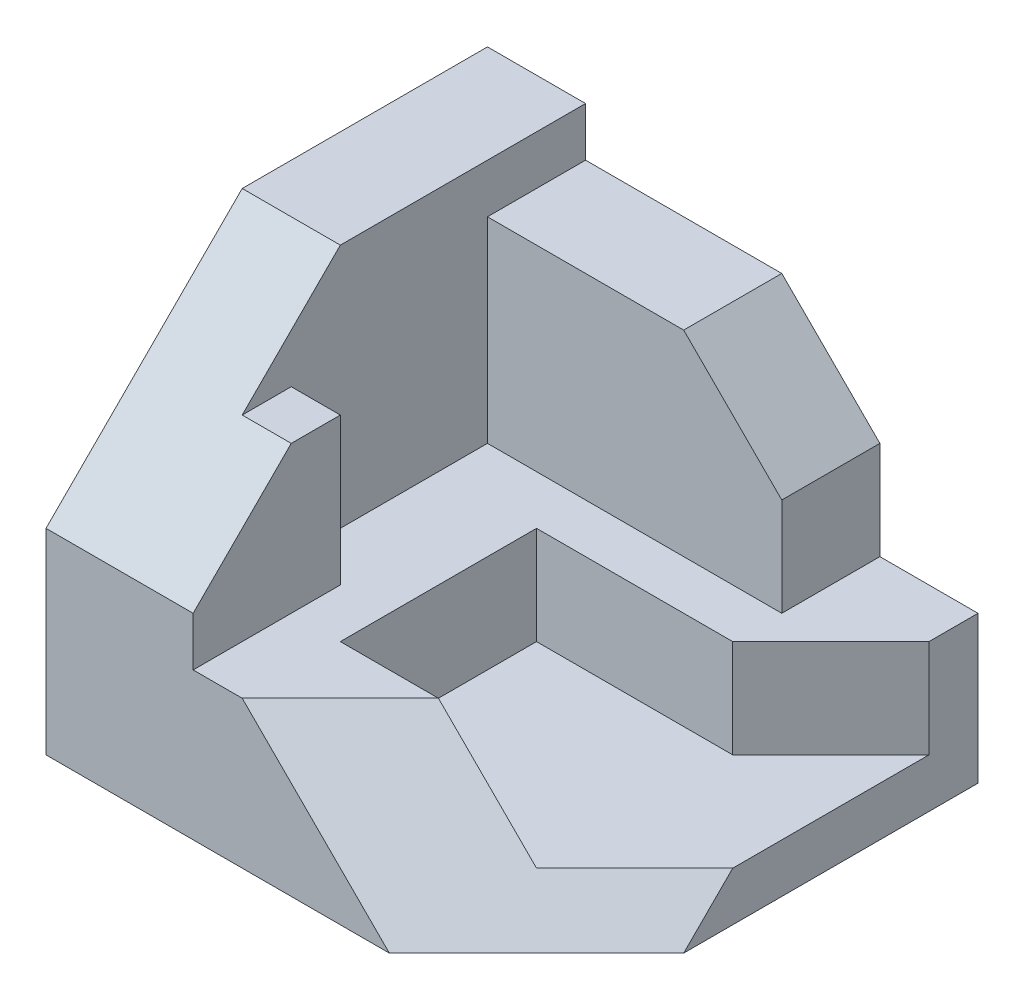
ISO-10303-21;
HEADER;
FILE_DESCRIPTION(('STEP AP214'),'2;1');
FILE_NAME('part.step','',(''),(''),'','','');
FILE_SCHEMA(('AUTOMOTIVE_DESIGN { 1 0 10303 214 1 1 1 1 }'));
ENDSEC;
DATA;
#1=APPLICATION_CONTEXT('core data for automotive mechanical design processes');
#2=APPLICATION_PROTOCOL_DEFINITION('international standard','automotive_design',2000,#1);
#3=PRODUCT_CONTEXT('',#1,'mechanical');
#4=PRODUCT('Part','Part','',(#3));
#5=PRODUCT_RELATED_PRODUCT_CATEGORY('part','',(#4));
#6=PRODUCT_DEFINITION_FORMATION('','',#4);
#7=PRODUCT_DEFINITION_CONTEXT('part definition',#1,'design');
#8=PRODUCT_DEFINITION('design','',#6,#7);
#9=PRODUCT_DEFINITION_SHAPE('','',#8);
#10=(LENGTH_UNIT() NAMED_UNIT(*) SI_UNIT(.MILLI.,.METRE.));
#11=(NAMED_UNIT(*) PLANE_ANGLE_UNIT() SI_UNIT($,.RADIAN.));
#12=(NAMED_UNIT(*) SI_UNIT($,.STERADIAN.) SOLID_ANGLE_UNIT());
#13=UNCERTAINTY_MEASURE_WITH_UNIT(LENGTH_MEASURE(1.E-05),#10,'distance_accuracy_value','');
#14=(GEOMETRIC_REPRESENTATION_CONTEXT(3) GLOBAL_UNCERTAINTY_ASSIGNED_CONTEXT((#13)) GLOBAL_UNIT_ASSIGNED_CONTEXT((#10,
#11,#12)) REPRESENTATION_CONTEXT('',''));
#15=CARTESIAN_POINT('',(0.,0.,0.));
#16=DIRECTION('',(0.,0.,1.));
#17=DIRECTION('',(1.,0.,0.));
#18=AXIS2_PLACEMENT_3D('',#15,#16,#17);
#19=CARTESIAN_POINT('',(100.,0.,-90.));
#20=DIRECTION('',(1.,0.,0.));
#21=DIRECTION('',(0.,0.,-1.));
#22=AXIS2_PLACEMENT_3D('',#19,#20,#21);
#23=PLANE('',#22);
#24=DIRECTION('',(0.,0.,-1.));
#25=VECTOR('',#24,1.);
#26=CARTESIAN_POINT('',(100.,10.,-80.));
#27=LINE('',#26,#25);
#28=CARTESIAN_POINT('',(100.,10.,-40.0000000000001));
#29=VERTEX_POINT('',#28);
#30=CARTESIAN_POINT('',(100.,10.,-80.));
#31=VERTEX_POINT('',#30);
#32=EDGE_CURVE('E188',#29,#31,#27,.T.);
#33=ORIENTED_EDGE('',*,*,#32,.F.);
#34=DIRECTION('',(0.,-0.707106781186546,0.707106781186549));
#35=VECTOR('',#34,1.);
#36=CARTESIAN_POINT('',(100.,10.,-40.0000000000001));
#37=LINE('',#36,#35);
#38=CARTESIAN_POINT('',(100.,0.,-30.));
#39=VERTEX_POINT('',#38);
#40=EDGE_CURVE('E172',#29,#39,#37,.T.);
#41=ORIENTED_EDGE('',*,*,#40,.T.);
#42=DIRECTION('',(0.,0.,1.));
#43=VECTOR('',#42,1.);
#44=CARTESIAN_POINT('',(100.,0.,-90.));
#45=LINE('',#44,#43);
#46=CARTESIAN_POINT('',(100.,0.,-90.));
#47=VERTEX_POINT('',#46);
#48=EDGE_CURVE('E325',#47,#39,#45,.T.);
#49=ORIENTED_EDGE('',*,*,#48,.F.);
#50=DIRECTION('',(0.,1.,0.));
#51=VECTOR('',#50,1.);
#52=CARTESIAN_POINT('',(100.,0.,-90.));
#53=LINE('',#52,#51);
#54=CARTESIAN_POINT('',(100.,30.,-90.));
#55=VERTEX_POINT('',#54);
#56=EDGE_CURVE('E313',#47,#55,#53,.T.);
#57=ORIENTED_EDGE('',*,*,#56,.T.);
#58=DIRECTION('',(0.,0.,1.));
#59=VECTOR('',#58,1.);
#60=CARTESIAN_POINT('',(100.,30.,-90.));
#61=LINE('',#60,#59);
#62=CARTESIAN_POINT('',(100.,30.,-80.));
#63=VERTEX_POINT('',#62);
#64=EDGE_CURVE('E292',#55,#63,#61,.T.);
#65=ORIENTED_EDGE('',*,*,#64,.T.);
#66=DIRECTION('',(0.,1.,0.));
#67=VECTOR('',#66,1.);
#68=CARTESIAN_POINT('',(100.,10.,-80.));
#69=LINE('',#68,#67);
#70=EDGE_CURVE('E48',#31,#63,#69,.T.);
#71=ORIENTED_EDGE('',*,*,#70,.F.);
#72=EDGE_LOOP('',(#33,#41,#49,#57,#65,#71));
#73=FACE_BOUND('',#72,.T.);
#74=ADVANCED_FACE('F33',(#73),#23,.T.);
#75=CARTESIAN_POINT('',(0.,10.,0.));
#76=DIRECTION('',(0.,1.,0.));
#77=DIRECTION('',(0.,0.,1.));
#78=AXIS2_PLACEMENT_3D('',#75,#76,#77);
#79=PLANE('',#78);
#80=DIRECTION('',(1.,0.,0.));
#81=VECTOR('',#80,1.);
#82=CARTESIAN_POINT('',(40.,10.,-20.));
#83=LINE('',#82,#81);
#84=CARTESIAN_POINT('',(40.,10.,-20.));
#85=VERTEX_POINT('',#84);
#86=CARTESIAN_POINT('',(80.,10.,-20.));
#87=VERTEX_POINT('',#86);
#88=EDGE_CURVE('E191',#85,#87,#83,.T.);
#89=ORIENTED_EDGE('',*,*,#88,.T.);
#90=DIRECTION('',(0.707106781186546,0.,-0.707106781186549));
#91=VECTOR('',#90,1.);
#92=CARTESIAN_POINT('',(80.,10.,-20.));
#93=LINE('',#92,#91);
#94=EDGE_CURVE('E175',#87,#29,#93,.T.);
#95=ORIENTED_EDGE('',*,*,#94,.T.);
#96=ORIENTED_EDGE('',*,*,#32,.T.);
#97=DIRECTION('',(-0.707106781186547,0.,0.707106781186548));
#98=VECTOR('',#97,1.);
#99=CARTESIAN_POINT('',(100.,10.,-80.));
#100=LINE('',#99,#98);
#101=CARTESIAN_POINT('',(80.,10.,-60.));
#102=VERTEX_POINT('',#101);
#103=EDGE_CURVE('E194',#31,#102,#100,.T.);
#104=ORIENTED_EDGE('',*,*,#103,.T.);
#105=DIRECTION('',(-1.,0.,0.));
#106=VECTOR('',#105,1.);
#107=CARTESIAN_POINT('',(80.,10.,-60.));
#108=LINE('',#107,#106);
#109=CARTESIAN_POINT('',(40.,10.,-60.));
#110=VERTEX_POINT('',#109);
#111=EDGE_CURVE('E197',#102,#110,#108,.T.);
#112=ORIENTED_EDGE('',*,*,#111,.T.);
#113=DIRECTION('',(0.,0.,1.));
#114=VECTOR('',#113,1.);
#115=CARTESIAN_POINT('',(40.,10.,-60.));
#116=LINE('',#115,#114);
#117=EDGE_CURVE('E208',#110,#85,#116,.T.);
#118=ORIENTED_EDGE('',*,*,#117,.T.);
#119=EDGE_LOOP('',(#89,#95,#96,#104,#112,#118));
#120=FACE_BOUND('',#119,.T.);
#121=ADVANCED_FACE('F186',(#120),#79,.T.);
#122=CARTESIAN_POINT('',(80.,30.,-90.));
#123=DIRECTION('',(0.,-1.,0.));
#124=DIRECTION('',(0.,0.,-1.));
#125=AXIS2_PLACEMENT_3D('',#122,#123,#124);
#126=PLANE('',#125);
#127=DIRECTION('',(-1.,0.,0.));
#128=VECTOR('',#127,1.);
#129=CARTESIAN_POINT('',(0.,30.,0.));
#130=LINE('',#129,#128);
#131=CARTESIAN_POINT('',(40.,30.,0.));
#132=VERTEX_POINT('',#131);
#133=CARTESIAN_POINT('',(30.,30.,0.));
#134=VERTEX_POINT('',#133);
#135=EDGE_CURVE('E233',#132,#134,#130,.T.);
#136=ORIENTED_EDGE('',*,*,#135,.F.);
#137=DIRECTION('',(-0.707106781186544,0.,0.707106781186551));
#138=VECTOR('',#137,1.);
#139=CARTESIAN_POINT('',(59.9999999999998,30.,-20.));
#140=LINE('',#139,#138);
#141=CARTESIAN_POINT('',(59.9999999999998,30.,-20.));
#142=VERTEX_POINT('',#141);
#143=EDGE_CURVE('E182',#142,#132,#140,.T.);
#144=ORIENTED_EDGE('',*,*,#143,.F.);
#145=DIRECTION('',(1.,0.,0.));
#146=VECTOR('',#145,1.);
#147=CARTESIAN_POINT('',(40.,30.,-20.));
#148=LINE('',#147,#146);
#149=CARTESIAN_POINT('',(40.,30.,-20.));
#150=VERTEX_POINT('',#149);
#151=EDGE_CURVE('E195',#150,#142,#148,.T.);
#152=ORIENTED_EDGE('',*,*,#151,.F.);
#153=DIRECTION('',(0.,0.,1.));
#154=VECTOR('',#153,1.);
#155=CARTESIAN_POINT('',(40.,30.,-60.));
#156=LINE('',#155,#154);
#157=CARTESIAN_POINT('',(40.,30.,-60.));
#158=VERTEX_POINT('',#157);
#159=EDGE_CURVE('E200',#158,#150,#156,.T.);
#160=ORIENTED_EDGE('',*,*,#159,.F.);
#161=DIRECTION('',(-1.,0.,0.));
#162=VECTOR('',#161,1.);
#163=CARTESIAN_POINT('',(80.,30.,-60.));
#164=LINE('',#163,#162);
#165=CARTESIAN_POINT('',(80.,30.,-60.));
#166=VERTEX_POINT('',#165);
#167=EDGE_CURVE('E213',#166,#158,#164,.T.);
#168=ORIENTED_EDGE('',*,*,#167,.F.);
#169=DIRECTION('',(-0.707106781186547,0.,0.707106781186548));
#170=VECTOR('',#169,1.);
#171=CARTESIAN_POINT('',(100.,30.,-80.));
#172=LINE('',#171,#170);
#173=EDGE_CURVE('E211',#63,#166,#172,.T.);
#174=ORIENTED_EDGE('',*,*,#173,.F.);
#175=ORIENTED_EDGE('',*,*,#64,.F.);
#176=DIRECTION('',(1.,0.,0.));
#177=VECTOR('',#176,1.);
#178=CARTESIAN_POINT('',(80.,30.,-90.));
#179=LINE('',#178,#177);
#180=CARTESIAN_POINT('',(80.,30.,-90.));
#181=VERTEX_POINT('',#180);
#182=EDGE_CURVE('E288',#181,#55,#179,.T.);
#183=ORIENTED_EDGE('',*,*,#182,.F.);
#184=DIRECTION('',(0.,0.,1.));
#185=VECTOR('',#184,1.);
#186=CARTESIAN_POINT('',(80.,30.,-90.));
#187=LINE('',#186,#185);
#188=CARTESIAN_POINT('',(80.,30.,-70.));
#189=VERTEX_POINT('',#188);
#190=EDGE_CURVE('E295',#181,#189,#187,.T.);
#191=ORIENTED_EDGE('',*,*,#190,.T.);
#192=DIRECTION('',(1.,0.,0.));
#193=VECTOR('',#192,1.);
#194=CARTESIAN_POINT('',(20.,30.,-70.));
#195=LINE('',#194,#193);
#196=CARTESIAN_POINT('',(20.,30.,-70.));
#197=VERTEX_POINT('',#196);
#198=EDGE_CURVE('E235',#197,#189,#195,.T.);
#199=ORIENTED_EDGE('',*,*,#198,.F.);
#200=DIRECTION('',(0.,0.,1.));
#201=VECTOR('',#200,1.);
#202=CARTESIAN_POINT('',(20.,30.,-90.));
#203=LINE('',#202,#201);
#204=CARTESIAN_POINT('',(20.,30.,-30.));
#205=VERTEX_POINT('',#204);
#206=EDGE_CURVE('E247',#197,#205,#203,.T.);
#207=ORIENTED_EDGE('',*,*,#206,.T.);
#208=DIRECTION('',(1.,0.,0.));
#209=VECTOR('',#208,1.);
#210=CARTESIAN_POINT('',(20.,30.,-30.));
#211=LINE('',#210,#209);
#212=CARTESIAN_POINT('',(30.,30.,-30.));
#213=VERTEX_POINT('',#212);
#214=EDGE_CURVE('E249',#205,#213,#211,.T.);
#215=ORIENTED_EDGE('',*,*,#214,.T.);
#216=DIRECTION('',(0.,0.,-1.));
#217=VECTOR('',#216,1.);
#218=CARTESIAN_POINT('',(30.,30.,9.99999999999999));
#219=LINE('',#218,#217);
#220=EDGE_CURVE('E228',#134,#213,#219,.T.);
#221=ORIENTED_EDGE('',*,*,#220,.F.);
#222=EDGE_LOOP('',(#136,#144,#152,#160,#168,#174,#175,#183,#191,#199,#207,#215,#221));
#223=FACE_BOUND('',#222,.T.);
#224=ADVANCED_FACE('F346',(#223),#126,.F.);
#225=CARTESIAN_POINT('',(0.,0.,0.));
#226=DIRECTION('',(0.,0.,-1.));
#227=DIRECTION('',(-1.,0.,0.));
#228=AXIS2_PLACEMENT_3D('',#225,#226,#227);
#229=PLANE('',#228);
#230=DIRECTION('',(1.,0.,0.));
#231=VECTOR('',#230,1.);
#232=CARTESIAN_POINT('',(0.,0.,0.));
#233=LINE('',#232,#231);
#234=CARTESIAN_POINT('',(0.,0.,0.));
#235=VERTEX_POINT('',#234);
#236=CARTESIAN_POINT('',(70.,0.,0.));
#237=VERTEX_POINT('',#236);
#238=EDGE_CURVE('E310',#235,#237,#233,.T.);
#239=ORIENTED_EDGE('',*,*,#238,.T.);
#240=DIRECTION('',(0.707106781186548,-0.707106781186547,0.));
#241=VECTOR('',#240,1.);
#242=CARTESIAN_POINT('',(40.,30.,0.));
#243=LINE('',#242,#241);
#244=EDGE_CURVE('E388',#132,#237,#243,.T.);
#245=ORIENTED_EDGE('',*,*,#244,.F.);
#246=ORIENTED_EDGE('',*,*,#135,.T.);
#247=DIRECTION('',(0.,1.,0.));
#248=VECTOR('',#247,1.);
#249=CARTESIAN_POINT('',(30.,0.,0.));
#250=LINE('',#249,#248);
#251=CARTESIAN_POINT('',(30.,40.,0.));
#252=VERTEX_POINT('',#251);
#253=EDGE_CURVE('E231',#134,#252,#250,.T.);
#254=ORIENTED_EDGE('',*,*,#253,.T.);
#255=DIRECTION('',(-1.,0.,0.));
#256=VECTOR('',#255,1.);
#257=CARTESIAN_POINT('',(90.,40.,0.));
#258=LINE('',#257,#256);
#259=CARTESIAN_POINT('',(0.,40.,0.));
#260=VERTEX_POINT('',#259);
#261=EDGE_CURVE('E273',#252,#260,#258,.T.);
#262=ORIENTED_EDGE('',*,*,#261,.T.);
#263=DIRECTION('',(0.,-1.,0.));
#264=VECTOR('',#263,1.);
#265=CARTESIAN_POINT('',(0.,0.,0.));
#266=LINE('',#265,#264);
#267=EDGE_CURVE('E294',#260,#235,#266,.T.);
#268=ORIENTED_EDGE('',*,*,#267,.T.);
#269=EDGE_LOOP('',(#239,#245,#246,#254,#262,#268));
#270=FACE_BOUND('',#269,.T.);
#271=ADVANCED_FACE('F341',(#270),#229,.F.);
#272=CARTESIAN_POINT('',(20.,80.,-90.));
#273=DIRECTION('',(-1.,0.,0.));
#274=DIRECTION('',(0.,0.,1.));
#275=AXIS2_PLACEMENT_3D('',#272,#273,#274);
#276=PLANE('',#275);
#277=DIRECTION('',(0.,-1.,0.));
#278=VECTOR('',#277,1.);
#279=CARTESIAN_POINT('',(20.,70.,-70.));
#280=LINE('',#279,#278);
#281=CARTESIAN_POINT('',(20.,70.,-70.));
#282=VERTEX_POINT('',#281);
#283=EDGE_CURVE('E56',#282,#197,#280,.T.);
#284=ORIENTED_EDGE('',*,*,#283,.F.);
#285=DIRECTION('',(0.,0.,1.));
#286=VECTOR('',#285,1.);
#287=CARTESIAN_POINT('',(20.,70.,-90.));
#288=LINE('',#287,#286);
#289=CARTESIAN_POINT('',(20.,70.,-90.));
#290=VERTEX_POINT('',#289);
#291=EDGE_CURVE('E236',#290,#282,#288,.T.);
#292=ORIENTED_EDGE('',*,*,#291,.F.);
#293=DIRECTION('',(0.,-1.,0.));
#294=VECTOR('',#293,1.);
#295=CARTESIAN_POINT('',(20.,80.,-90.));
#296=LINE('',#295,#294);
#297=CARTESIAN_POINT('',(20.,80.,-90.));
#298=VERTEX_POINT('',#297);
#299=EDGE_CURVE('E279',#298,#290,#296,.T.);
#300=ORIENTED_EDGE('',*,*,#299,.F.);
#301=DIRECTION('',(0.,0.,1.));
#302=VECTOR('',#301,1.);
#303=CARTESIAN_POINT('',(20.,80.,-90.));
#304=LINE('',#303,#302);
#305=CARTESIAN_POINT('',(20.,80.,-40.));
#306=VERTEX_POINT('',#305);
#307=EDGE_CURVE('E291',#298,#306,#304,.T.);
#308=ORIENTED_EDGE('',*,*,#307,.T.);
#309=DIRECTION('',(0.,-0.707106781186547,0.707106781186547));
#310=VECTOR('',#309,1.);
#311=CARTESIAN_POINT('',(20.,105.,-65.));
#312=LINE('',#311,#310);
#313=CARTESIAN_POINT('',(20.,60.,-20.));
#314=VERTEX_POINT('',#313);
#315=EDGE_CURVE('E275',#306,#314,#312,.T.);
#316=ORIENTED_EDGE('',*,*,#315,.T.);
#317=DIRECTION('',(0.,0.,-1.));
#318=VECTOR('',#317,1.);
#319=CARTESIAN_POINT('',(20.,60.,30.));
#320=LINE('',#319,#318);
#321=CARTESIAN_POINT('',(20.,60.,-30.));
#322=VERTEX_POINT('',#321);
#323=EDGE_CURVE('E255',#314,#322,#320,.T.);
#324=ORIENTED_EDGE('',*,*,#323,.T.);
#325=DIRECTION('',(0.,1.,0.));
#326=VECTOR('',#325,1.);
#327=CARTESIAN_POINT('',(20.,10.,-30.));
#328=LINE('',#327,#326);
#329=EDGE_CURVE('E267',#205,#322,#328,.T.);
#330=ORIENTED_EDGE('',*,*,#329,.F.);
#331=ORIENTED_EDGE('',*,*,#206,.F.);
#332=EDGE_LOOP('',(#284,#292,#300,#308,#316,#324,#330,#331));
#333=FACE_BOUND('',#332,.T.);
#334=ADVANCED_FACE('F352',(#333),#276,.F.);
#335=CARTESIAN_POINT('',(0.,0.,-90.));
#336=DIRECTION('',(-1.,0.,0.));
#337=DIRECTION('',(0.,0.,1.));
#338=AXIS2_PLACEMENT_3D('',#335,#336,#337);
#339=PLANE('',#338);
#340=DIRECTION('',(0.,-0.707106781186548,0.707106781186548));
#341=VECTOR('',#340,1.);
#342=CARTESIAN_POINT('',(0.,80.,-40.));
#343=LINE('',#342,#341);
#344=CARTESIAN_POINT('',(0.,80.,-40.));
#345=VERTEX_POINT('',#344);
#346=EDGE_CURVE('E269',#345,#260,#343,.T.);
#347=ORIENTED_EDGE('',*,*,#346,.F.);
#348=DIRECTION('',(0.,0.,1.));
#349=VECTOR('',#348,1.);
#350=CARTESIAN_POINT('',(0.,80.,-90.));
#351=LINE('',#350,#349);
#352=CARTESIAN_POINT('',(0.,80.,-90.));
#353=VERTEX_POINT('',#352);
#354=EDGE_CURVE('E322',#353,#345,#351,.T.);
#355=ORIENTED_EDGE('',*,*,#354,.F.);
#356=DIRECTION('',(0.,-1.,0.));
#357=VECTOR('',#356,1.);
#358=CARTESIAN_POINT('',(0.,0.,-90.));
#359=LINE('',#358,#357);
#360=CARTESIAN_POINT('',(0.,0.,-90.));
#361=VERTEX_POINT('',#360);
#362=EDGE_CURVE('E306',#353,#361,#359,.T.);
#363=ORIENTED_EDGE('',*,*,#362,.T.);
#364=DIRECTION('',(0.,0.,1.));
#365=VECTOR('',#364,1.);
#366=CARTESIAN_POINT('',(0.,0.,-90.));
#367=LINE('',#366,#365);
#368=EDGE_CURVE('E318',#361,#235,#367,.T.);
#369=ORIENTED_EDGE('',*,*,#368,.T.);
#370=ORIENTED_EDGE('',*,*,#267,.F.);
#371=EDGE_LOOP('',(#347,#355,#363,#369,#370));
#372=FACE_BOUND('',#371,.T.);
#373=ADVANCED_FACE('F35',(#372),#339,.T.);
#374=CARTESIAN_POINT('',(0.,80.,-90.));
#375=DIRECTION('',(0.,1.,0.));
#376=DIRECTION('',(0.,0.,1.));
#377=AXIS2_PLACEMENT_3D('',#374,#375,#376);
#378=PLANE('',#377);
#379=DIRECTION('',(-1.,0.,0.));
#380=VECTOR('',#379,1.);
#381=CARTESIAN_POINT('',(90.,80.,-40.));
#382=LINE('',#381,#380);
#383=EDGE_CURVE('E272',#306,#345,#382,.T.);
#384=ORIENTED_EDGE('',*,*,#383,.F.);
#385=ORIENTED_EDGE('',*,*,#307,.F.);
#386=DIRECTION('',(-1.,0.,0.));
#387=VECTOR('',#386,1.);
#388=CARTESIAN_POINT('',(0.,80.,-90.));
#389=LINE('',#388,#387);
#390=EDGE_CURVE('E316',#298,#353,#389,.T.);
#391=ORIENTED_EDGE('',*,*,#390,.T.);
#392=ORIENTED_EDGE('',*,*,#354,.T.);
#393=EDGE_LOOP('',(#384,#385,#391,#392));
#394=FACE_BOUND('',#393,.T.);
#395=ADVANCED_FACE('F373',(#394),#378,.T.);
#396=CARTESIAN_POINT('',(0.,0.,-90.));
#397=DIRECTION('',(0.,-1.,0.));
#398=DIRECTION('',(0.,0.,-1.));
#399=AXIS2_PLACEMENT_3D('',#396,#397,#398);
#400=PLANE('',#399);
#401=DIRECTION('',(0.707106781186547,0.,-0.707106781186547));
#402=VECTOR('',#401,1.);
#403=CARTESIAN_POINT('',(70.,0.,0.));
#404=LINE('',#403,#402);
#405=EDGE_CURVE('E178',#237,#39,#404,.T.);
#406=ORIENTED_EDGE('',*,*,#405,.F.);
#407=ORIENTED_EDGE('',*,*,#238,.F.);
#408=ORIENTED_EDGE('',*,*,#368,.F.);
#409=DIRECTION('',(1.,0.,0.));
#410=VECTOR('',#409,1.);
#411=CARTESIAN_POINT('',(0.,0.,-90.));
#412=LINE('',#411,#410);
#413=EDGE_CURVE('E309',#361,#47,#412,.T.);
#414=ORIENTED_EDGE('',*,*,#413,.T.);
#415=ORIENTED_EDGE('',*,*,#48,.T.);
#416=EDGE_LOOP('',(#406,#407,#408,#414,#415));
#417=FACE_BOUND('',#416,.T.);
#418=ADVANCED_FACE('F375',(#417),#400,.T.);
#419=CARTESIAN_POINT('',(0.,0.,-90.));
#420=DIRECTION('',(0.,0.,-1.));
#421=DIRECTION('',(-1.,0.,0.));
#422=AXIS2_PLACEMENT_3D('',#419,#420,#421);
#423=PLANE('',#422);
#424=DIRECTION('',(-1.,0.,0.));
#425=VECTOR('',#424,1.);
#426=CARTESIAN_POINT('',(20.,70.,-90.));
#427=LINE('',#426,#425);
#428=CARTESIAN_POINT('',(60.,70.,-90.));
#429=VERTEX_POINT('',#428);
#430=EDGE_CURVE('E242',#429,#290,#427,.T.);
#431=ORIENTED_EDGE('',*,*,#430,.F.);
#432=DIRECTION('',(0.707106781186548,-0.707106781186547,0.));
#433=VECTOR('',#432,1.);
#434=CARTESIAN_POINT('',(60.,70.,-90.));
#435=LINE('',#434,#433);
#436=CARTESIAN_POINT('',(80.,50.,-90.));
#437=VERTEX_POINT('',#436);
#438=EDGE_CURVE('E282',#429,#437,#435,.T.);
#439=ORIENTED_EDGE('',*,*,#438,.T.);
#440=DIRECTION('',(0.,-1.,0.));
#441=VECTOR('',#440,1.);
#442=CARTESIAN_POINT('',(80.,50.,-90.));
#443=LINE('',#442,#441);
#444=EDGE_CURVE('E285',#437,#181,#443,.T.);
#445=ORIENTED_EDGE('',*,*,#444,.T.);
#446=ORIENTED_EDGE('',*,*,#182,.T.);
#447=ORIENTED_EDGE('',*,*,#56,.F.);
#448=ORIENTED_EDGE('',*,*,#413,.F.);
#449=ORIENTED_EDGE('',*,*,#362,.F.);
#450=ORIENTED_EDGE('',*,*,#390,.F.);
#451=ORIENTED_EDGE('',*,*,#299,.T.);
#452=EDGE_LOOP('',(#431,#439,#445,#446,#447,#448,#449,#450,#451));
#453=FACE_BOUND('',#452,.T.);
#454=ADVANCED_FACE('F377',(#453),#423,.T.);
#455=CARTESIAN_POINT('',(80.,50.,-90.));
#456=DIRECTION('',(-1.,0.,0.));
#457=DIRECTION('',(0.,-1.,0.));
#458=AXIS2_PLACEMENT_3D('',#455,#456,#457);
#459=PLANE('',#458);
#460=DIRECTION('',(0.,0.,1.));
#461=VECTOR('',#460,1.);
#462=CARTESIAN_POINT('',(80.,50.,-90.));
#463=LINE('',#462,#461);
#464=CARTESIAN_POINT('',(80.,50.,-70.));
#465=VERTEX_POINT('',#464);
#466=EDGE_CURVE('E298',#437,#465,#463,.T.);
#467=ORIENTED_EDGE('',*,*,#466,.T.);
#468=DIRECTION('',(0.,-1.,0.));
#469=VECTOR('',#468,1.);
#470=CARTESIAN_POINT('',(80.,50.,-70.));
#471=LINE('',#470,#469);
#472=EDGE_CURVE('E220',#465,#189,#471,.T.);
#473=ORIENTED_EDGE('',*,*,#472,.T.);
#474=ORIENTED_EDGE('',*,*,#190,.F.);
#475=ORIENTED_EDGE('',*,*,#444,.F.);
#476=EDGE_LOOP('',(#467,#473,#474,#475));
#477=FACE_BOUND('',#476,.T.);
#478=ADVANCED_FACE('F383',(#477),#459,.F.);
#479=CARTESIAN_POINT('',(60.,70.,-90.));
#480=DIRECTION('',(-0.707106781186547,-0.707106781186547,0.));
#481=DIRECTION('',(0.707106781186548,-0.707106781186547,0.));
#482=AXIS2_PLACEMENT_3D('',#479,#480,#481);
#483=PLANE('',#482);
#484=DIRECTION('',(0.,0.,1.));
#485=VECTOR('',#484,1.);
#486=CARTESIAN_POINT('',(60.,70.,-90.));
#487=LINE('',#486,#485);
#488=CARTESIAN_POINT('',(60.,70.,-70.));
#489=VERTEX_POINT('',#488);
#490=EDGE_CURVE('E301',#429,#489,#487,.T.);
#491=ORIENTED_EDGE('',*,*,#490,.T.);
#492=DIRECTION('',(0.707106781186548,-0.707106781186547,0.));
#493=VECTOR('',#492,1.);
#494=CARTESIAN_POINT('',(60.,70.,-70.));
#495=LINE('',#494,#493);
#496=EDGE_CURVE('E11',#489,#465,#495,.T.);
#497=ORIENTED_EDGE('',*,*,#496,.T.);
#498=ORIENTED_EDGE('',*,*,#466,.F.);
#499=ORIENTED_EDGE('',*,*,#438,.F.);
#500=EDGE_LOOP('',(#491,#497,#498,#499));
#501=FACE_BOUND('',#500,.T.);
#502=ADVANCED_FACE('F432',(#501),#483,.F.);
#503=CARTESIAN_POINT('',(90.,80.,-40.));
#504=DIRECTION('',(0.,-0.707106781186547,-0.707106781186547));
#505=DIRECTION('',(0.,0.707106781186548,-0.707106781186548));
#506=AXIS2_PLACEMENT_3D('',#503,#504,#505);
#507=PLANE('',#506);
#508=DIRECTION('',(-1.,0.,0.));
#509=VECTOR('',#508,1.);
#510=CARTESIAN_POINT('',(90.,60.,-20.));
#511=LINE('',#510,#509);
#512=CARTESIAN_POINT('',(30.,60.,-20.));
#513=VERTEX_POINT('',#512);
#514=EDGE_CURVE('E258',#513,#314,#511,.T.);
#515=ORIENTED_EDGE('',*,*,#514,.T.);
#516=ORIENTED_EDGE('',*,*,#315,.F.);
#517=ORIENTED_EDGE('',*,*,#383,.T.);
#518=ORIENTED_EDGE('',*,*,#346,.T.);
#519=ORIENTED_EDGE('',*,*,#261,.F.);
#520=DIRECTION('',(0.,0.707106781186548,-0.707106781186548));
#521=VECTOR('',#520,1.);
#522=CARTESIAN_POINT('',(30.,80.,-40.));
#523=LINE('',#522,#521);
#524=EDGE_CURVE('E264',#252,#513,#523,.T.);
#525=ORIENTED_EDGE('',*,*,#524,.T.);
#526=EDGE_LOOP('',(#515,#516,#517,#518,#519,#525));
#527=FACE_BOUND('',#526,.T.);
#528=ADVANCED_FACE('F337',(#527),#507,.F.);
#529=CARTESIAN_POINT('',(60.,10.,-30.));
#530=DIRECTION('',(0.,0.,1.));
#531=DIRECTION('',(1.,0.,0.));
#532=AXIS2_PLACEMENT_3D('',#529,#530,#531);
#533=PLANE('',#532);
#534=DIRECTION('',(0.,1.,0.));
#535=VECTOR('',#534,1.);
#536=CARTESIAN_POINT('',(30.,70.,-30.));
#537=LINE('',#536,#535);
#538=CARTESIAN_POINT('',(30.,60.,-30.));
#539=VERTEX_POINT('',#538);
#540=EDGE_CURVE('E261',#213,#539,#537,.T.);
#541=ORIENTED_EDGE('',*,*,#540,.F.);
#542=ORIENTED_EDGE('',*,*,#214,.F.);
#543=ORIENTED_EDGE('',*,*,#329,.T.);
#544=DIRECTION('',(-1.,0.,0.));
#545=VECTOR('',#544,1.);
#546=CARTESIAN_POINT('',(20.,60.,-30.));
#547=LINE('',#546,#545);
#548=EDGE_CURVE('E252',#539,#322,#547,.T.);
#549=ORIENTED_EDGE('',*,*,#548,.F.);
#550=EDGE_LOOP('',(#541,#542,#543,#549));
#551=FACE_BOUND('',#550,.T.);
#552=ADVANCED_FACE('F351',(#551),#533,.F.);
#553=CARTESIAN_POINT('',(30.,70.,30.));
#554=DIRECTION('',(-1.,0.,0.));
#555=DIRECTION('',(0.,-1.,0.));
#556=AXIS2_PLACEMENT_3D('',#553,#554,#555);
#557=PLANE('',#556);
#558=ORIENTED_EDGE('',*,*,#540,.T.);
#559=DIRECTION('',(0.,0.,1.));
#560=VECTOR('',#559,1.);
#561=CARTESIAN_POINT('',(30.,60.,30.));
#562=LINE('',#561,#560);
#563=EDGE_CURVE('E41',#539,#513,#562,.T.);
#564=ORIENTED_EDGE('',*,*,#563,.T.);
#565=ORIENTED_EDGE('',*,*,#524,.F.);
#566=ORIENTED_EDGE('',*,*,#253,.F.);
#567=ORIENTED_EDGE('',*,*,#220,.T.);
#568=EDGE_LOOP('',(#558,#564,#565,#566,#567));
#569=FACE_BOUND('',#568,.T.);
#570=ADVANCED_FACE('F331',(#569),#557,.F.);
#571=CARTESIAN_POINT('',(20.,60.,30.));
#572=DIRECTION('',(0.,-1.,0.));
#573=DIRECTION('',(1.,0.,0.));
#574=AXIS2_PLACEMENT_3D('',#571,#572,#573);
#575=PLANE('',#574);
#576=ORIENTED_EDGE('',*,*,#563,.F.);
#577=ORIENTED_EDGE('',*,*,#548,.T.);
#578=ORIENTED_EDGE('',*,*,#323,.F.);
#579=ORIENTED_EDGE('',*,*,#514,.F.);
#580=EDGE_LOOP('',(#576,#577,#578,#579));
#581=FACE_BOUND('',#580,.T.);
#582=ADVANCED_FACE('F354',(#581),#575,.F.);
#583=CARTESIAN_POINT('',(20.,70.,-70.));
#584=DIRECTION('',(0.,0.,-1.));
#585=DIRECTION('',(-1.,0.,0.));
#586=AXIS2_PLACEMENT_3D('',#583,#584,#585);
#587=PLANE('',#586);
#588=ORIENTED_EDGE('',*,*,#198,.T.);
#589=ORIENTED_EDGE('',*,*,#472,.F.);
#590=ORIENTED_EDGE('',*,*,#496,.F.);
#591=DIRECTION('',(1.,0.,0.));
#592=VECTOR('',#591,1.);
#593=CARTESIAN_POINT('',(20.,70.,-70.));
#594=LINE('',#593,#592);
#595=EDGE_CURVE('E239',#282,#489,#594,.T.);
#596=ORIENTED_EDGE('',*,*,#595,.F.);
#597=ORIENTED_EDGE('',*,*,#283,.T.);
#598=EDGE_LOOP('',(#588,#589,#590,#596,#597));
#599=FACE_BOUND('',#598,.T.);
#600=ADVANCED_FACE('F356',(#599),#587,.F.);
#601=CARTESIAN_POINT('',(0.,70.,0.));
#602=DIRECTION('',(0.,1.,0.));
#603=DIRECTION('',(0.,0.,1.));
#604=AXIS2_PLACEMENT_3D('',#601,#602,#603);
#605=PLANE('',#604);
#606=ORIENTED_EDGE('',*,*,#291,.T.);
#607=ORIENTED_EDGE('',*,*,#595,.T.);
#608=ORIENTED_EDGE('',*,*,#490,.F.);
#609=ORIENTED_EDGE('',*,*,#430,.T.);
#610=EDGE_LOOP('',(#606,#607,#608,#609));
#611=FACE_BOUND('',#610,.T.);
#612=ADVANCED_FACE('F362',(#611),#605,.T.);
#613=CARTESIAN_POINT('',(40.,10.,-20.));
#614=DIRECTION('',(0.,0.,1.));
#615=DIRECTION('',(1.,0.,0.));
#616=AXIS2_PLACEMENT_3D('',#613,#614,#615);
#617=PLANE('',#616);
#618=ORIENTED_EDGE('',*,*,#151,.T.);
#619=DIRECTION('',(0.707106781186551,-0.707106781186544,0.));
#620=VECTOR('',#619,1.);
#621=CARTESIAN_POINT('',(80.,10.,-20.));
#622=LINE('',#621,#620);
#623=EDGE_CURVE('E203',#142,#87,#622,.T.);
#624=ORIENTED_EDGE('',*,*,#623,.T.);
#625=ORIENTED_EDGE('',*,*,#88,.F.);
#626=DIRECTION('',(0.,1.,0.));
#627=VECTOR('',#626,1.);
#628=CARTESIAN_POINT('',(40.,10.,-20.));
#629=LINE('',#628,#627);
#630=EDGE_CURVE('E218',#85,#150,#629,.T.);
#631=ORIENTED_EDGE('',*,*,#630,.T.);
#632=EDGE_LOOP('',(#618,#624,#625,#631));
#633=FACE_BOUND('',#632,.T.);
#634=ADVANCED_FACE('F393',(#633),#617,.F.);
#635=CARTESIAN_POINT('',(40.,10.,-60.));
#636=DIRECTION('',(-1.,0.,0.));
#637=DIRECTION('',(0.,0.,1.));
#638=AXIS2_PLACEMENT_3D('',#635,#636,#637);
#639=PLANE('',#638);
#640=ORIENTED_EDGE('',*,*,#159,.T.);
#641=ORIENTED_EDGE('',*,*,#630,.F.);
#642=ORIENTED_EDGE('',*,*,#117,.F.);
#643=DIRECTION('',(0.,1.,0.));
#644=VECTOR('',#643,1.);
#645=CARTESIAN_POINT('',(40.,10.,-60.));
#646=LINE('',#645,#644);
#647=EDGE_CURVE('E221',#110,#158,#646,.T.);
#648=ORIENTED_EDGE('',*,*,#647,.T.);
#649=EDGE_LOOP('',(#640,#641,#642,#648));
#650=FACE_BOUND('',#649,.T.);
#651=ADVANCED_FACE('F396',(#650),#639,.F.);
#652=CARTESIAN_POINT('',(80.,10.,-60.));
#653=DIRECTION('',(0.,0.,-1.));
#654=DIRECTION('',(-1.,0.,0.));
#655=AXIS2_PLACEMENT_3D('',#652,#653,#654);
#656=PLANE('',#655);
#657=ORIENTED_EDGE('',*,*,#167,.T.);
#658=ORIENTED_EDGE('',*,*,#647,.F.);
#659=ORIENTED_EDGE('',*,*,#111,.F.);
#660=DIRECTION('',(0.,1.,0.));
#661=VECTOR('',#660,1.);
#662=CARTESIAN_POINT('',(80.,10.,-60.));
#663=LINE('',#662,#661);
#664=EDGE_CURVE('E223',#102,#166,#663,.T.);
#665=ORIENTED_EDGE('',*,*,#664,.T.);
#666=EDGE_LOOP('',(#657,#658,#659,#665));
#667=FACE_BOUND('',#666,.T.);
#668=ADVANCED_FACE('F399',(#667),#656,.F.);
#669=CARTESIAN_POINT('',(100.,10.,-80.));
#670=DIRECTION('',(-0.707106781186548,0.,-0.707106781186547));
#671=DIRECTION('',(-0.707106781186547,0.,0.707106781186548));
#672=AXIS2_PLACEMENT_3D('',#669,#670,#671);
#673=PLANE('',#672);
#674=ORIENTED_EDGE('',*,*,#173,.T.);
#675=ORIENTED_EDGE('',*,*,#664,.F.);
#676=ORIENTED_EDGE('',*,*,#103,.F.);
#677=ORIENTED_EDGE('',*,*,#70,.T.);
#678=EDGE_LOOP('',(#674,#675,#676,#677));
#679=FACE_BOUND('',#678,.T.);
#680=ADVANCED_FACE('F401',(#679),#673,.F.);
#681=CARTESIAN_POINT('',(23.3333333333335,23.3333333333335,23.3333333333333));
#682=DIRECTION('',(-0.577350269189628,-0.577350269189628,-0.577350269189621));
#683=DIRECTION('',(0.707106781186547,-0.707106781186548,0.));
#684=AXIS2_PLACEMENT_3D('',#681,#682,#683);
#685=PLANE('',#684);
#686=ORIENTED_EDGE('',*,*,#623,.F.);
#687=ORIENTED_EDGE('',*,*,#143,.T.);
#688=ORIENTED_EDGE('',*,*,#244,.T.);
#689=ORIENTED_EDGE('',*,*,#405,.T.);
#690=ORIENTED_EDGE('',*,*,#40,.F.);
#691=ORIENTED_EDGE('',*,*,#94,.F.);
#692=EDGE_LOOP('',(#686,#687,#688,#689,#690,#691));
#693=FACE_BOUND('',#692,.T.);
#694=ADVANCED_FACE('F174',(#693),#685,.F.);
#695=CLOSED_SHELL('',(#74,#121,#224,#271,#334,#373,#395,#418,#454,#478,#502,#528,#552,#570,#582,
#600,#612,#634,#651,#668,#680,#694));
#696=MANIFOLD_SOLID_BREP('B2',#695);
#697=ADVANCED_BREP_SHAPE_REPRESENTATION('',(#18,#696),#14);
#698=SHAPE_DEFINITION_REPRESENTATION(#9,#697);
ENDSEC;
END-ISO-10303-21;
